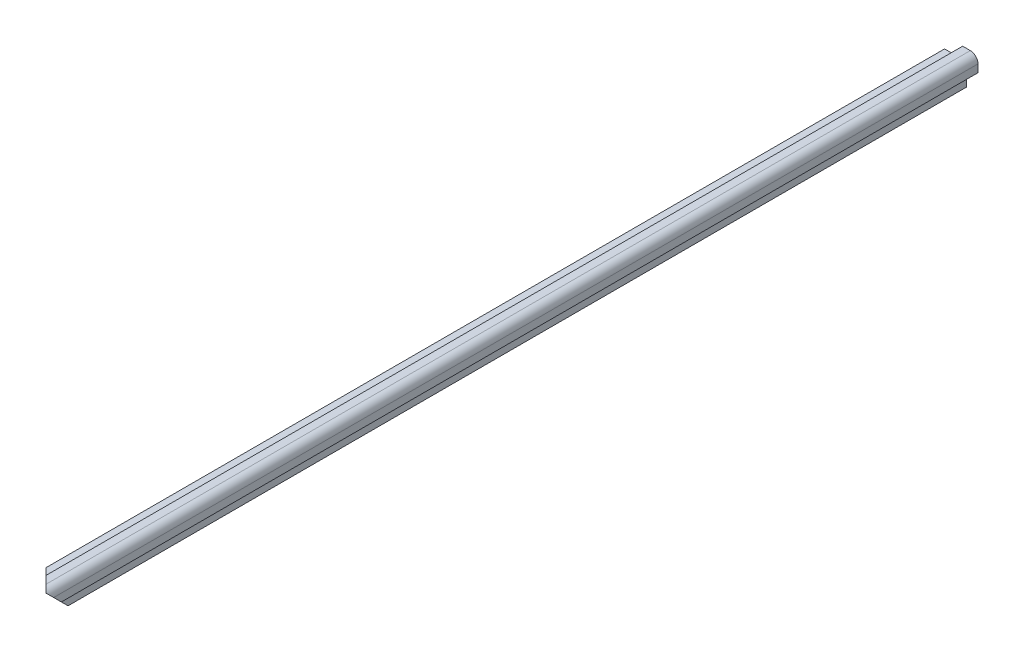
ISO-10303-21;
HEADER;
FILE_DESCRIPTION(('STEP AP214'),'2;1');
FILE_NAME('part.step','',(''),(''),'','','');
FILE_SCHEMA(('AUTOMOTIVE_DESIGN { 1 0 10303 214 1 1 1 1 }'));
ENDSEC;
DATA;
#1=APPLICATION_CONTEXT('core data for automotive mechanical design processes');
#2=APPLICATION_PROTOCOL_DEFINITION('international standard','automotive_design',2000,#1);
#3=PRODUCT_CONTEXT('',#1,'mechanical');
#4=PRODUCT('Part','Part','',(#3));
#5=PRODUCT_RELATED_PRODUCT_CATEGORY('part','',(#4));
#6=PRODUCT_DEFINITION_FORMATION('','',#4);
#7=PRODUCT_DEFINITION_CONTEXT('part definition',#1,'design');
#8=PRODUCT_DEFINITION('design','',#6,#7);
#9=PRODUCT_DEFINITION_SHAPE('','',#8);
#10=(LENGTH_UNIT() NAMED_UNIT(*) SI_UNIT(.MILLI.,.METRE.));
#11=(NAMED_UNIT(*) PLANE_ANGLE_UNIT() SI_UNIT($,.RADIAN.));
#12=(NAMED_UNIT(*) SI_UNIT($,.STERADIAN.) SOLID_ANGLE_UNIT());
#13=UNCERTAINTY_MEASURE_WITH_UNIT(LENGTH_MEASURE(1.E-05),#10,'distance_accuracy_value','');
#14=(GEOMETRIC_REPRESENTATION_CONTEXT(3) GLOBAL_UNCERTAINTY_ASSIGNED_CONTEXT((#13)) GLOBAL_UNIT_ASSIGNED_CONTEXT((#10,
#11,#12)) REPRESENTATION_CONTEXT('',''));
#15=CARTESIAN_POINT('',(0.,0.,0.));
#16=DIRECTION('',(0.,0.,1.));
#17=DIRECTION('',(1.,0.,0.));
#18=AXIS2_PLACEMENT_3D('',#15,#16,#17);
#19=CARTESIAN_POINT('',(-7.3025,-3.621225168,130.175));
#20=DIRECTION('',(0.,1.,0.));
#21=DIRECTION('',(0.,0.,1.));
#22=AXIS2_PLACEMENT_3D('',#19,#20,#21);
#23=PLANE('',#22);
#24=DIRECTION('',(0.,0.,-1.));
#25=VECTOR('',#24,1.);
#26=CARTESIAN_POINT('',(-5.8662891982673,-3.621225168,130.175));
#27=LINE('',#26,#25);
#28=CARTESIAN_POINT('',(-5.8662891982673,-3.621225168,107.838588801733));
#29=VERTEX_POINT('',#28);
#30=CARTESIAN_POINT('',(-5.8662891982673,-3.621225168,-130.175));
#31=VERTEX_POINT('',#30);
#32=EDGE_CURVE('E58',#29,#31,#27,.T.);
#33=ORIENTED_EDGE('',*,*,#32,.F.);
#34=DIRECTION('',(-0.707106781186545,0.,-0.707106781186551));
#35=VECTOR('',#34,1.);
#36=CARTESIAN_POINT('',(4.583811,-3.621225168,118.288689));
#37=LINE('',#36,#35);
#38=CARTESIAN_POINT('',(-7.3025,-3.621225168,106.402378));
#39=VERTEX_POINT('',#38);
#40=EDGE_CURVE('E137',#29,#39,#37,.T.);
#41=ORIENTED_EDGE('',*,*,#40,.T.);
#42=DIRECTION('',(0.,0.,-1.));
#43=VECTOR('',#42,1.);
#44=CARTESIAN_POINT('',(-7.3025,-3.621225168,130.175));
#45=LINE('',#44,#43);
#46=CARTESIAN_POINT('',(-7.3025,-3.621225168,-130.175));
#47=VERTEX_POINT('',#46);
#48=EDGE_CURVE('E209',#39,#47,#45,.T.);
#49=ORIENTED_EDGE('',*,*,#48,.T.);
#50=DIRECTION('',(1.,0.,0.));
#51=VECTOR('',#50,1.);
#52=CARTESIAN_POINT('',(-7.3025,-3.621225168,-130.175));
#53=LINE('',#52,#51);
#54=EDGE_CURVE('E200',#47,#31,#53,.T.);
#55=ORIENTED_EDGE('',*,*,#54,.T.);
#56=EDGE_LOOP('',(#33,#41,#49,#55));
#57=FACE_BOUND('',#56,.T.);
#58=ADVANCED_FACE('F36',(#57),#23,.F.);
#59=CARTESIAN_POINT('',(-3.62122516800001,-2.53999999999999,130.175));
#60=DIRECTION('',(1.,0.,0.));
#61=DIRECTION('',(0.,1.,0.));
#62=AXIS2_PLACEMENT_3D('',#59,#60,#61);
#63=PLANE('',#62);
#64=DIRECTION('',(0.,0.,-1.));
#65=VECTOR('',#64,1.);
#66=CARTESIAN_POINT('',(-3.62122516800002,-7.30249999999999,130.175));
#67=LINE('',#66,#65);
#68=CARTESIAN_POINT('',(-3.62122516800002,-7.30249999999999,106.402378));
#69=VERTEX_POINT('',#68);
#70=CARTESIAN_POINT('',(-3.62122516800002,-7.30249999999999,-130.175));
#71=VERTEX_POINT('',#70);
#72=EDGE_CURVE('E195',#69,#71,#67,.T.);
#73=ORIENTED_EDGE('',*,*,#72,.F.);
#74=DIRECTION('',(0.,0.707106781186552,0.707106781186543));
#75=VECTOR('',#74,1.);
#76=CARTESIAN_POINT('',(-3.62122516799998,6.96506099999998,120.669939));
#77=LINE('',#76,#75);
#78=CARTESIAN_POINT('',(-3.62122516800001,-5.86628919826729,107.838588801733));
#79=VERTEX_POINT('',#78);
#80=EDGE_CURVE('E144',#69,#79,#77,.T.);
#81=ORIENTED_EDGE('',*,*,#80,.T.);
#82=DIRECTION('',(0.,0.,-1.));
#83=VECTOR('',#82,1.);
#84=CARTESIAN_POINT('',(-3.62122516800001,-5.86628919826729,130.175));
#85=LINE('',#84,#83);
#86=CARTESIAN_POINT('',(-3.62122516800001,-5.86628919826729,-130.175));
#87=VERTEX_POINT('',#86);
#88=EDGE_CURVE('E177',#79,#87,#85,.T.);
#89=ORIENTED_EDGE('',*,*,#88,.T.);
#90=DIRECTION('',(0.,-1.,0.));
#91=VECTOR('',#90,1.);
#92=CARTESIAN_POINT('',(-3.62122516800001,-2.53999999999999,-130.175));
#93=LINE('',#92,#91);
#94=EDGE_CURVE('E182',#87,#71,#93,.T.);
#95=ORIENTED_EDGE('',*,*,#94,.T.);
#96=EDGE_LOOP('',(#73,#81,#89,#95));
#97=FACE_BOUND('',#96,.T.);
#98=ADVANCED_FACE('F216',(#97),#63,.F.);
#99=CARTESIAN_POINT('',(-7.3025,-1.500000048,130.175));
#100=DIRECTION('',(1.,0.,0.));
#101=DIRECTION('',(0.,0.,-1.));
#102=AXIS2_PLACEMENT_3D('',#99,#100,#101);
#103=PLANE('',#102);
#104=ORIENTED_EDGE('',*,*,#48,.F.);
#105=DIRECTION('',(0.,1.,0.));
#106=VECTOR('',#105,1.);
#107=CARTESIAN_POINT('',(-7.3025,-1.50000004800021,106.402378));
#108=LINE('',#107,#106);
#109=CARTESIAN_POINT('',(-7.3025,-1.500000048,106.402378));
#110=VERTEX_POINT('',#109);
#111=EDGE_CURVE('E231',#39,#110,#108,.T.);
#112=ORIENTED_EDGE('',*,*,#111,.T.);
#113=DIRECTION('',(0.,0.,-1.));
#114=VECTOR('',#113,1.);
#115=CARTESIAN_POINT('',(-7.3025,-1.500000048,130.175));
#116=LINE('',#115,#114);
#117=CARTESIAN_POINT('',(-7.3025,-1.500000048,-130.175));
#118=VERTEX_POINT('',#117);
#119=EDGE_CURVE('E205',#110,#118,#116,.T.);
#120=ORIENTED_EDGE('',*,*,#119,.T.);
#121=DIRECTION('',(0.,-1.,0.));
#122=VECTOR('',#121,1.);
#123=CARTESIAN_POINT('',(-7.3025,-1.500000048,-130.175));
#124=LINE('',#123,#122);
#125=EDGE_CURVE('E197',#118,#47,#124,.T.);
#126=ORIENTED_EDGE('',*,*,#125,.T.);
#127=EDGE_LOOP('',(#104,#112,#120,#126));
#128=FACE_BOUND('',#127,.T.);
#129=ADVANCED_FACE('F38',(#128),#103,.F.);
#130=CARTESIAN_POINT('',(-7.3025,-1.500000048,130.175));
#131=DIRECTION('',(0.,-1.,0.));
#132=DIRECTION('',(1.,0.,0.));
#133=AXIS2_PLACEMENT_3D('',#130,#131,#132);
#134=PLANE('',#133);
#135=ORIENTED_EDGE('',*,*,#119,.F.);
#136=DIRECTION('',(0.707106781186545,0.,0.707106781186551));
#137=VECTOR('',#136,1.);
#138=CARTESIAN_POINT('',(4.58381100000001,-1.500000048,118.288689));
#139=LINE('',#138,#137);
#140=CARTESIAN_POINT('',(-2.54,-1.500000048,111.164878));
#141=VERTEX_POINT('',#140);
#142=EDGE_CURVE('E234',#110,#141,#139,.T.);
#143=ORIENTED_EDGE('',*,*,#142,.T.);
#144=DIRECTION('',(0.,0.,-1.));
#145=VECTOR('',#144,1.);
#146=CARTESIAN_POINT('',(-2.54,-1.500000048,130.175));
#147=LINE('',#146,#145);
#148=CARTESIAN_POINT('',(-2.54,-1.500000048,-130.175));
#149=VERTEX_POINT('',#148);
#150=EDGE_CURVE('E207',#141,#149,#147,.T.);
#151=ORIENTED_EDGE('',*,*,#150,.T.);
#152=DIRECTION('',(-1.,0.,0.));
#153=VECTOR('',#152,1.);
#154=CARTESIAN_POINT('',(-7.3025,-1.500000048,-130.175));
#155=LINE('',#154,#153);
#156=EDGE_CURVE('E202',#149,#118,#155,.T.);
#157=ORIENTED_EDGE('',*,*,#156,.T.);
#158=EDGE_LOOP('',(#135,#143,#151,#157));
#159=FACE_BOUND('',#158,.T.);
#160=ADVANCED_FACE('F255',(#159),#134,.F.);
#161=CARTESIAN_POINT('',(0.,0.,-130.175));
#162=DIRECTION('',(0.,0.,1.));
#163=DIRECTION('',(1.,0.,0.));
#164=AXIS2_PLACEMENT_3D('',#161,#162,#163);
#165=PLANE('',#164);
#166=DIRECTION('',(0.707106781186547,-0.707106781186548,0.));
#167=VECTOR('',#166,1.);
#168=CARTESIAN_POINT('',(-5.8662891982673,-3.621225168,-130.175));
#169=LINE('',#168,#167);
#170=EDGE_CURVE('E162',#31,#87,#169,.T.);
#171=ORIENTED_EDGE('',*,*,#170,.F.);
#172=ORIENTED_EDGE('',*,*,#54,.F.);
#173=ORIENTED_EDGE('',*,*,#125,.F.);
#174=ORIENTED_EDGE('',*,*,#156,.F.);
#175=DIRECTION('',(0.,-1.,0.));
#176=VECTOR('',#175,1.);
#177=CARTESIAN_POINT('',(-2.54,1.500000048,-130.175));
#178=LINE('',#177,#176);
#179=CARTESIAN_POINT('',(-2.54,1.500000048,-130.175));
#180=VERTEX_POINT('',#179);
#181=EDGE_CURVE('E154',#180,#149,#178,.T.);
#182=ORIENTED_EDGE('',*,*,#181,.F.);
#183=DIRECTION('',(-1.,0.,0.));
#184=VECTOR('',#183,1.);
#185=CARTESIAN_POINT('',(-2.54,1.500000048,-130.175));
#186=LINE('',#185,#184);
#187=CARTESIAN_POINT('',(-0.51999997599999,1.50000004799999,-130.175));
#188=VERTEX_POINT('',#187);
#189=EDGE_CURVE('E150',#188,#180,#186,.T.);
#190=ORIENTED_EDGE('',*,*,#189,.F.);
#191=CARTESIAN_POINT('',(-0.519999976000003,-0.519999976000009,-130.175));
#192=DIRECTION('',(0.,0.,1.));
#193=DIRECTION('',(-1.,0.,0.));
#194=AXIS2_PLACEMENT_3D('',#191,#192,#193);
#195=CIRCLE('',#194,2.020000024);
#196=CARTESIAN_POINT('',(1.50000004799999,-0.519999976000009,-130.175));
#197=VERTEX_POINT('',#196);
#198=EDGE_CURVE('E170',#197,#188,#195,.T.);
#199=ORIENTED_EDGE('',*,*,#198,.F.);
#200=DIRECTION('',(0.,1.,0.));
#201=VECTOR('',#200,1.);
#202=CARTESIAN_POINT('',(1.50000004799999,-0.519999976000009,-130.175));
#203=LINE('',#202,#201);
#204=CARTESIAN_POINT('',(1.50000004799999,-2.54,-130.175));
#205=VERTEX_POINT('',#204);
#206=EDGE_CURVE('E167',#205,#197,#203,.T.);
#207=ORIENTED_EDGE('',*,*,#206,.F.);
#208=DIRECTION('',(1.,0.,0.));
#209=VECTOR('',#208,1.);
#210=CARTESIAN_POINT('',(-1.50000004800001,-2.53999999999999,-130.175));
#211=LINE('',#210,#209);
#212=CARTESIAN_POINT('',(-1.50000004800001,-2.53999999999999,-130.175));
#213=VERTEX_POINT('',#212);
#214=EDGE_CURVE('E164',#213,#205,#211,.T.);
#215=ORIENTED_EDGE('',*,*,#214,.F.);
#216=DIRECTION('',(0.,1.,0.));
#217=VECTOR('',#216,1.);
#218=CARTESIAN_POINT('',(-1.50000004800001,-2.53999999999999,-130.175));
#219=LINE('',#218,#217);
#220=CARTESIAN_POINT('',(-1.50000004800003,-7.30249999999999,-130.175));
#221=VERTEX_POINT('',#220);
#222=EDGE_CURVE('E188',#221,#213,#219,.T.);
#223=ORIENTED_EDGE('',*,*,#222,.F.);
#224=DIRECTION('',(1.,0.,0.));
#225=VECTOR('',#224,1.);
#226=CARTESIAN_POINT('',(-1.50000004800003,-7.30249999999999,-130.175));
#227=LINE('',#226,#225);
#228=EDGE_CURVE('E185',#71,#221,#227,.T.);
#229=ORIENTED_EDGE('',*,*,#228,.F.);
#230=ORIENTED_EDGE('',*,*,#94,.F.);
#231=EDGE_LOOP('',(#171,#172,#173,#174,#182,#190,#199,#207,#215,#223,#229,#230));
#232=FACE_BOUND('',#231,.T.);
#233=ADVANCED_FACE('F248',(#232),#165,.F.);
#234=CARTESIAN_POINT('',(-1.50000004800003,-7.30249999999999,130.175));
#235=DIRECTION('',(0.,1.,0.));
#236=DIRECTION('',(-1.,0.,0.));
#237=AXIS2_PLACEMENT_3D('',#234,#235,#236);
#238=PLANE('',#237);
#239=DIRECTION('',(0.,0.,-1.));
#240=VECTOR('',#239,1.);
#241=CARTESIAN_POINT('',(-1.50000004800003,-7.30249999999999,130.175));
#242=LINE('',#241,#240);
#243=CARTESIAN_POINT('',(-1.50000004800003,-7.30249999999999,106.402378));
#244=VERTEX_POINT('',#243);
#245=EDGE_CURVE('E193',#244,#221,#242,.T.);
#246=ORIENTED_EDGE('',*,*,#245,.F.);
#247=DIRECTION('',(-1.,0.,0.));
#248=VECTOR('',#247,1.);
#249=CARTESIAN_POINT('',(-1.50000004799973,-7.30249999999999,106.402378));
#250=LINE('',#249,#248);
#251=EDGE_CURVE('E218',#244,#69,#250,.T.);
#252=ORIENTED_EDGE('',*,*,#251,.T.);
#253=ORIENTED_EDGE('',*,*,#72,.T.);
#254=ORIENTED_EDGE('',*,*,#228,.T.);
#255=EDGE_LOOP('',(#246,#252,#253,#254));
#256=FACE_BOUND('',#255,.T.);
#257=ADVANCED_FACE('F264',(#256),#238,.F.);
#258=CARTESIAN_POINT('',(-1.50000004800001,-2.53999999999999,130.175));
#259=DIRECTION('',(-1.,0.,0.));
#260=DIRECTION('',(0.,-1.,0.));
#261=AXIS2_PLACEMENT_3D('',#258,#259,#260);
#262=PLANE('',#261);
#263=DIRECTION('',(0.,0.,-1.));
#264=VECTOR('',#263,1.);
#265=CARTESIAN_POINT('',(-1.50000004800001,-2.53999999999999,130.175));
#266=LINE('',#265,#264);
#267=CARTESIAN_POINT('',(-1.50000004800001,-2.53999999999999,111.164878));
#268=VERTEX_POINT('',#267);
#269=EDGE_CURVE('E191',#268,#213,#266,.T.);
#270=ORIENTED_EDGE('',*,*,#269,.F.);
#271=DIRECTION('',(0.,-0.707106781186552,-0.707106781186543));
#272=VECTOR('',#271,1.);
#273=CARTESIAN_POINT('',(-1.50000004799998,6.96506099999996,120.669939));
#274=LINE('',#273,#272);
#275=EDGE_CURVE('E220',#268,#244,#274,.T.);
#276=ORIENTED_EDGE('',*,*,#275,.T.);
#277=ORIENTED_EDGE('',*,*,#245,.T.);
#278=ORIENTED_EDGE('',*,*,#222,.T.);
#279=EDGE_LOOP('',(#270,#276,#277,#278));
#280=FACE_BOUND('',#279,.T.);
#281=ADVANCED_FACE('F267',(#280),#262,.F.);
#282=CARTESIAN_POINT('',(-0.519999976000003,-0.519999976000009,130.175));
#283=DIRECTION('',(0.,0.,-1.));
#284=DIRECTION('',(-1.,0.,0.));
#285=AXIS2_PLACEMENT_3D('',#282,#283,#284);
#286=CYLINDRICAL_SURFACE('',#285,2.020000024);
#287=DIRECTION('',(0.,0.,-1.));
#288=VECTOR('',#287,1.);
#289=CARTESIAN_POINT('',(-0.51999997599999,1.50000004799999,130.175));
#290=LINE('',#289,#288);
#291=CARTESIAN_POINT('',(-0.51999997599999,1.50000004799999,113.184878024));
#292=VERTEX_POINT('',#291);
#293=EDGE_CURVE('E149',#292,#188,#290,.T.);
#294=ORIENTED_EDGE('',*,*,#293,.F.);
#295=CARTESIAN_POINT('',(-0.519999976000003,-0.519999976000009,113.184878024));
#296=DIRECTION('',(0.70710678118655,0.,-0.707106781186544));
#297=DIRECTION('',(-0.707106781186545,0.,-0.707106781186551));
#298=AXIS2_PLACEMENT_3D('',#295,#296,#297);
#299=ELLIPSE('',#298,2.85671142993478,2.020000024);
#300=CARTESIAN_POINT('',(0.908355738967402,0.908355738967363,114.613233738967));
#301=VERTEX_POINT('',#300);
#302=EDGE_CURVE('E141',#292,#301,#299,.T.);
#303=ORIENTED_EDGE('',*,*,#302,.T.);
#304=CARTESIAN_POINT('',(-0.519999976000003,-0.519999976000009,113.184878024));
#305=DIRECTION('',(0.,0.707106781186543,-0.707106781186552));
#306=DIRECTION('',(0.,-0.707106781186552,-0.707106781186543));
#307=AXIS2_PLACEMENT_3D('',#304,#305,#306);
#308=ELLIPSE('',#307,2.85671142993475,2.020000024);
#309=CARTESIAN_POINT('',(1.50000004799999,-0.519999976000008,113.184878024));
#310=VERTEX_POINT('',#309);
#311=EDGE_CURVE('E130',#301,#310,#308,.T.);
#312=ORIENTED_EDGE('',*,*,#311,.T.);
#313=DIRECTION('',(0.,0.,-1.));
#314=VECTOR('',#313,1.);
#315=CARTESIAN_POINT('',(1.50000004799999,-0.519999976000009,130.175));
#316=LINE('',#315,#314);
#317=EDGE_CURVE('E173',#310,#197,#316,.T.);
#318=ORIENTED_EDGE('',*,*,#317,.T.);
#319=ORIENTED_EDGE('',*,*,#198,.T.);
#320=EDGE_LOOP('',(#294,#303,#312,#318,#319));
#321=FACE_BOUND('',#320,.T.);
#322=ADVANCED_FACE('F147',(#321),#286,.T.);
#323=CARTESIAN_POINT('',(1.50000004799999,-0.519999976000009,130.175));
#324=DIRECTION('',(-1.,0.,0.));
#325=DIRECTION('',(0.,0.,1.));
#326=AXIS2_PLACEMENT_3D('',#323,#324,#325);
#327=PLANE('',#326);
#328=ORIENTED_EDGE('',*,*,#317,.F.);
#329=DIRECTION('',(0.,-0.707106781186552,-0.707106781186543));
#330=VECTOR('',#329,1.);
#331=CARTESIAN_POINT('',(1.50000004799999,7.97506101199995,121.679939012));
#332=LINE('',#331,#330);
#333=CARTESIAN_POINT('',(1.50000004799999,-2.54,111.164878));
#334=VERTEX_POINT('',#333);
#335=EDGE_CURVE('E133',#310,#334,#332,.T.);
#336=ORIENTED_EDGE('',*,*,#335,.T.);
#337=DIRECTION('',(0.,0.,-1.));
#338=VECTOR('',#337,1.);
#339=CARTESIAN_POINT('',(1.50000004799999,-2.54,130.175));
#340=LINE('',#339,#338);
#341=EDGE_CURVE('E175',#334,#205,#340,.T.);
#342=ORIENTED_EDGE('',*,*,#341,.T.);
#343=ORIENTED_EDGE('',*,*,#206,.T.);
#344=EDGE_LOOP('',(#328,#336,#342,#343));
#345=FACE_BOUND('',#344,.T.);
#346=ADVANCED_FACE('F272',(#345),#327,.F.);
#347=CARTESIAN_POINT('',(-1.50000004800001,-2.53999999999999,130.175));
#348=DIRECTION('',(0.,1.,0.));
#349=DIRECTION('',(-1.,0.,0.));
#350=AXIS2_PLACEMENT_3D('',#347,#348,#349);
#351=PLANE('',#350);
#352=ORIENTED_EDGE('',*,*,#341,.F.);
#353=DIRECTION('',(-1.,0.,0.));
#354=VECTOR('',#353,1.);
#355=CARTESIAN_POINT('',(-1.50000004799977,-2.53999999999999,111.164878));
#356=LINE('',#355,#354);
#357=EDGE_CURVE('E225',#334,#268,#356,.T.);
#358=ORIENTED_EDGE('',*,*,#357,.T.);
#359=ORIENTED_EDGE('',*,*,#269,.T.);
#360=ORIENTED_EDGE('',*,*,#214,.T.);
#361=EDGE_LOOP('',(#352,#358,#359,#360));
#362=FACE_BOUND('',#361,.T.);
#363=ADVANCED_FACE('F270',(#362),#351,.F.);
#364=CARTESIAN_POINT('',(-2.54,1.500000048,130.175));
#365=DIRECTION('',(1.,0.,0.));
#366=DIRECTION('',(0.,0.,-1.));
#367=AXIS2_PLACEMENT_3D('',#364,#365,#366);
#368=PLANE('',#367);
#369=ORIENTED_EDGE('',*,*,#150,.F.);
#370=DIRECTION('',(0.,1.,0.));
#371=VECTOR('',#370,1.);
#372=CARTESIAN_POINT('',(-2.54,1.50000004799983,111.164878));
#373=LINE('',#372,#371);
#374=CARTESIAN_POINT('',(-2.54,1.500000048,111.164878));
#375=VERTEX_POINT('',#374);
#376=EDGE_CURVE('E156',#141,#375,#373,.T.);
#377=ORIENTED_EDGE('',*,*,#376,.T.);
#378=DIRECTION('',(0.,0.,-1.));
#379=VECTOR('',#378,1.);
#380=CARTESIAN_POINT('',(-2.54,1.500000048,130.175));
#381=LINE('',#380,#379);
#382=EDGE_CURVE('E180',#375,#180,#381,.T.);
#383=ORIENTED_EDGE('',*,*,#382,.T.);
#384=ORIENTED_EDGE('',*,*,#181,.T.);
#385=EDGE_LOOP('',(#369,#377,#383,#384));
#386=FACE_BOUND('',#385,.T.);
#387=ADVANCED_FACE('F240',(#386),#368,.F.);
#388=CARTESIAN_POINT('',(-2.54,1.500000048,130.175));
#389=DIRECTION('',(0.,-1.,0.));
#390=DIRECTION('',(1.,0.,0.));
#391=AXIS2_PLACEMENT_3D('',#388,#389,#390);
#392=PLANE('',#391);
#393=ORIENTED_EDGE('',*,*,#382,.F.);
#394=DIRECTION('',(0.707106781186545,0.,0.707106781186551));
#395=VECTOR('',#394,1.);
#396=CARTESIAN_POINT('',(6.965061,1.50000004799994,120.669939));
#397=LINE('',#396,#395);
#398=EDGE_CURVE('E151',#375,#292,#397,.T.);
#399=ORIENTED_EDGE('',*,*,#398,.T.);
#400=ORIENTED_EDGE('',*,*,#293,.T.);
#401=ORIENTED_EDGE('',*,*,#189,.T.);
#402=EDGE_LOOP('',(#393,#399,#400,#401));
#403=FACE_BOUND('',#402,.T.);
#404=ADVANCED_FACE('F243',(#403),#392,.F.);
#405=CARTESIAN_POINT('',(-5.8662891982673,-3.621225168,130.175));
#406=DIRECTION('',(0.707106781186548,0.707106781186547,0.));
#407=DIRECTION('',(-0.707106781186547,0.707106781186548,0.));
#408=AXIS2_PLACEMENT_3D('',#405,#406,#407);
#409=PLANE('',#408);
#410=DIRECTION('',(-0.577350269189631,0.577350269189631,0.577350269189615));
#411=VECTOR('',#410,1.);
#412=CARTESIAN_POINT('',(-12.5634049209339,3.0758905546666,116.780768554666));
#413=LINE('',#412,#411);
#414=CARTESIAN_POINT('',(-4.74375718313364,-4.74375718313366,108.961120816866));
#415=VERTEX_POINT('',#414);
#416=EDGE_CURVE('E44',#79,#415,#413,.T.);
#417=ORIENTED_EDGE('',*,*,#416,.T.);
#418=DIRECTION('',(-0.577350269189622,0.577350269189623,-0.577350269189632));
#419=VECTOR('',#418,1.);
#420=CARTESIAN_POINT('',(1.57918120115517,-11.0666955674225,115.284059201155));
#421=LINE('',#420,#419);
#422=EDGE_CURVE('E11',#415,#29,#421,.T.);
#423=ORIENTED_EDGE('',*,*,#422,.T.);
#424=ORIENTED_EDGE('',*,*,#32,.T.);
#425=ORIENTED_EDGE('',*,*,#170,.T.);
#426=ORIENTED_EDGE('',*,*,#88,.F.);
#427=EDGE_LOOP('',(#417,#423,#424,#425,#426));
#428=FACE_BOUND('',#427,.T.);
#429=ADVANCED_FACE('F211',(#428),#409,.F.);
#430=CARTESIAN_POINT('',(6.49004069866668,6.49004069866662,120.194918698667));
#431=DIRECTION('',(0.70710678118655,0.,-0.707106781186544));
#432=DIRECTION('',(-0.707106781186545,0.,-0.707106781186551));
#433=AXIS2_PLACEMENT_3D('',#430,#431,#432);
#434=PLANE('',#433);
#435=ORIENTED_EDGE('',*,*,#398,.F.);
#436=ORIENTED_EDGE('',*,*,#376,.F.);
#437=ORIENTED_EDGE('',*,*,#142,.F.);
#438=ORIENTED_EDGE('',*,*,#111,.F.);
#439=ORIENTED_EDGE('',*,*,#40,.F.);
#440=ORIENTED_EDGE('',*,*,#422,.F.);
#441=DIRECTION('',(-0.577350269189626,-0.577350269189625,-0.577350269189626));
#442=VECTOR('',#441,1.);
#443=CARTESIAN_POINT('',(6.49004069866668,6.49004069866662,120.194918698667));
#444=LINE('',#443,#442);
#445=EDGE_CURVE('E51',#301,#415,#444,.T.);
#446=ORIENTED_EDGE('',*,*,#445,.F.);
#447=ORIENTED_EDGE('',*,*,#302,.F.);
#448=EDGE_LOOP('',(#435,#436,#437,#438,#439,#440,#446,#447));
#449=FACE_BOUND('',#448,.T.);
#450=ADVANCED_FACE('F140',(#449),#434,.F.);
#451=CARTESIAN_POINT('',(15.3027566673177,2.08368271434102,115.788560714341));
#452=DIRECTION('',(0.,0.707106781186543,-0.707106781186552));
#453=DIRECTION('',(0.,0.707106781186552,0.707106781186543));
#454=AXIS2_PLACEMENT_3D('',#451,#452,#453);
#455=PLANE('',#454);
#456=ORIENTED_EDGE('',*,*,#445,.T.);
#457=ORIENTED_EDGE('',*,*,#416,.F.);
#458=ORIENTED_EDGE('',*,*,#80,.F.);
#459=ORIENTED_EDGE('',*,*,#251,.F.);
#460=ORIENTED_EDGE('',*,*,#275,.F.);
#461=ORIENTED_EDGE('',*,*,#357,.F.);
#462=ORIENTED_EDGE('',*,*,#335,.F.);
#463=ORIENTED_EDGE('',*,*,#311,.F.);
#464=EDGE_LOOP('',(#456,#457,#458,#459,#460,#461,#462,#463));
#465=FACE_BOUND('',#464,.T.);
#466=ADVANCED_FACE('F131',(#465),#455,.F.);
#467=CLOSED_SHELL('',(#58,#98,#129,#160,#233,#257,#281,#322,#346,#363,#387,#404,#429,#450,#466));
#468=MANIFOLD_SOLID_BREP('B2',#467);
#469=ADVANCED_BREP_SHAPE_REPRESENTATION('',(#18,#468),#14);
#470=SHAPE_DEFINITION_REPRESENTATION(#9,#469);
ENDSEC;
END-ISO-10303-21;
